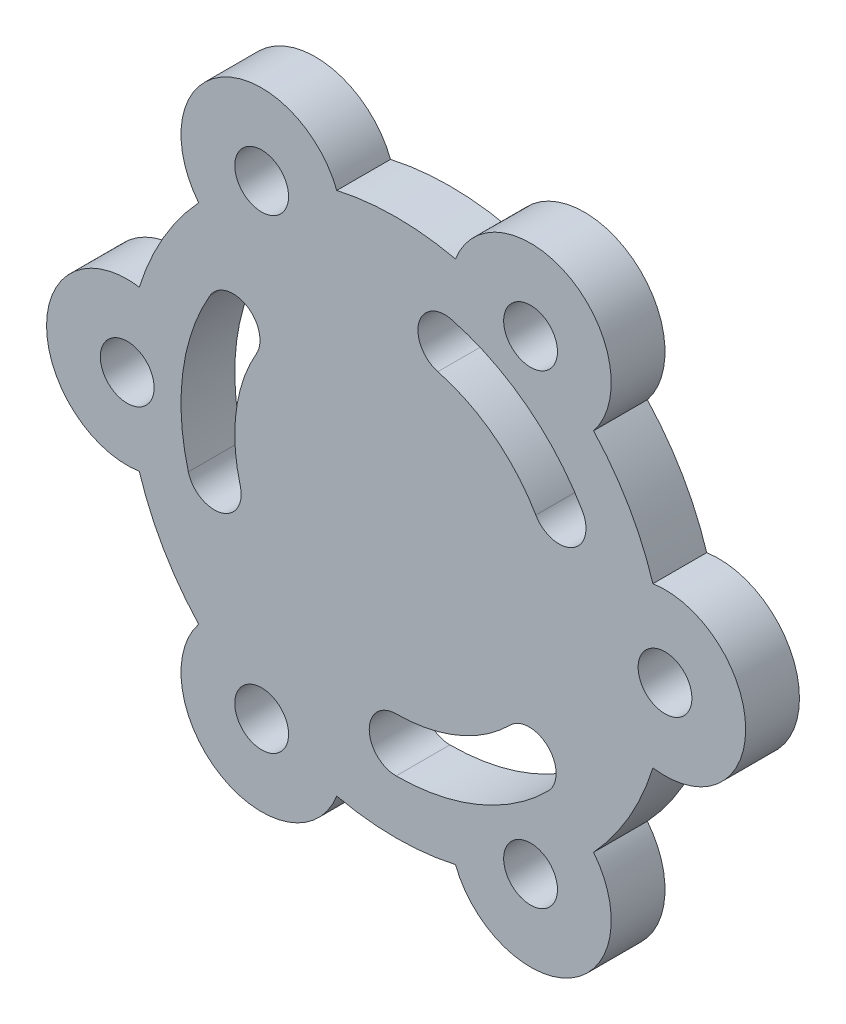
ISO-10303-21;
HEADER;
FILE_DESCRIPTION(('STEP AP214'),'2;1');
FILE_NAME('part.step','',(''),(''),'','','');
FILE_SCHEMA(('AUTOMOTIVE_DESIGN { 1 0 10303 214 1 1 1 1 }'));
ENDSEC;
DATA;
#1=APPLICATION_CONTEXT('core data for automotive mechanical design processes');
#2=APPLICATION_PROTOCOL_DEFINITION('international standard','automotive_design',2000,#1);
#3=PRODUCT_CONTEXT('',#1,'mechanical');
#4=PRODUCT('Part','Part','',(#3));
#5=PRODUCT_RELATED_PRODUCT_CATEGORY('part','',(#4));
#6=PRODUCT_DEFINITION_FORMATION('','',#4);
#7=PRODUCT_DEFINITION_CONTEXT('part definition',#1,'design');
#8=PRODUCT_DEFINITION('design','',#6,#7);
#9=PRODUCT_DEFINITION_SHAPE('','',#8);
#10=(LENGTH_UNIT() NAMED_UNIT(*) SI_UNIT(.MILLI.,.METRE.));
#11=(NAMED_UNIT(*) PLANE_ANGLE_UNIT() SI_UNIT($,.RADIAN.));
#12=(NAMED_UNIT(*) SI_UNIT($,.STERADIAN.) SOLID_ANGLE_UNIT());
#13=UNCERTAINTY_MEASURE_WITH_UNIT(LENGTH_MEASURE(1.E-05),#10,'distance_accuracy_value','');
#14=(GEOMETRIC_REPRESENTATION_CONTEXT(3) GLOBAL_UNCERTAINTY_ASSIGNED_CONTEXT((#13)) GLOBAL_UNIT_ASSIGNED_CONTEXT((#10,
#11,#12)) REPRESENTATION_CONTEXT('',''));
#15=CARTESIAN_POINT('',(0.,0.,0.));
#16=DIRECTION('',(0.,0.,1.));
#17=DIRECTION('',(1.,0.,0.));
#18=AXIS2_PLACEMENT_3D('',#15,#16,#17);
#19=CARTESIAN_POINT('',(25.,-43.3012701892219,10.));
#20=DIRECTION('',(0.,0.,-1.));
#21=DIRECTION('',(-1.,0.,0.));
#22=AXIS2_PLACEMENT_3D('',#19,#20,#21);
#23=CYLINDRICAL_SURFACE('',#22,15.);
#24=CARTESIAN_POINT('',(25.,-43.3012701892219,0.));
#25=DIRECTION('',(0.,0.,1.));
#26=DIRECTION('',(1.,0.,0.));
#27=AXIS2_PLACEMENT_3D('',#24,#25,#26);
#28=CIRCLE('',#27,15.);
#29=CARTESIAN_POINT('',(11.0315921578422,-48.7678580056889,0.));
#30=VERTEX_POINT('',#29);
#31=CARTESIAN_POINT('',(36.7184078421578,-33.937568055725,0.));
#32=VERTEX_POINT('',#31);
#33=EDGE_CURVE('E285',#30,#32,#28,.T.);
#34=ORIENTED_EDGE('',*,*,#33,.T.);
#35=DIRECTION('',(0.,0.,-1.));
#36=VECTOR('',#35,1.);
#37=CARTESIAN_POINT('',(36.7184078421578,-33.937568055725,10.));
#38=LINE('',#37,#36);
#39=CARTESIAN_POINT('',(36.7184078421578,-33.937568055725,10.));
#40=VERTEX_POINT('',#39);
#41=EDGE_CURVE('E11',#40,#32,#38,.T.);
#42=ORIENTED_EDGE('',*,*,#41,.F.);
#43=CARTESIAN_POINT('',(25.,-43.3012701892219,10.));
#44=DIRECTION('',(0.,0.,1.));
#45=DIRECTION('',(1.,0.,0.));
#46=AXIS2_PLACEMENT_3D('',#43,#44,#45);
#47=CIRCLE('',#46,15.);
#48=CARTESIAN_POINT('',(11.0315921578422,-48.7678580056889,10.));
#49=VERTEX_POINT('',#48);
#50=EDGE_CURVE('E419',#49,#40,#47,.T.);
#51=ORIENTED_EDGE('',*,*,#50,.F.);
#52=DIRECTION('',(0.,0.,-1.));
#53=VECTOR('',#52,1.);
#54=CARTESIAN_POINT('',(11.0315921578422,-48.7678580056889,10.));
#55=LINE('',#54,#53);
#56=EDGE_CURVE('E308',#49,#30,#55,.T.);
#57=ORIENTED_EDGE('',*,*,#56,.T.);
#58=EDGE_LOOP('',(#34,#42,#51,#57));
#59=FACE_BOUND('',#58,.T.);
#60=ADVANCED_FACE('F35',(#59),#23,.T.);
#61=CARTESIAN_POINT('',(0.,0.,10.));
#62=DIRECTION('',(0.,0.,-1.));
#63=DIRECTION('',(-1.,0.,0.));
#64=AXIS2_PLACEMENT_3D('',#61,#62,#63);
#65=CYLINDRICAL_SURFACE('',#64,50.);
#66=CARTESIAN_POINT('',(0.,0.,0.));
#67=DIRECTION('',(0.,0.,1.));
#68=DIRECTION('',(1.,0.,0.));
#69=AXIS2_PLACEMENT_3D('',#66,#67,#68);
#70=CIRCLE('',#69,50.);
#71=CARTESIAN_POINT('',(47.75,-14.8302899499639,0.));
#72=VERTEX_POINT('',#71);
#73=EDGE_CURVE('E288',#32,#72,#70,.T.);
#74=ORIENTED_EDGE('',*,*,#73,.T.);
#75=DIRECTION('',(0.,0.,-1.));
#76=VECTOR('',#75,1.);
#77=CARTESIAN_POINT('',(47.75,-14.8302899499639,10.));
#78=LINE('',#77,#76);
#79=CARTESIAN_POINT('',(47.75,-14.8302899499639,10.));
#80=VERTEX_POINT('',#79);
#81=EDGE_CURVE('E45',#80,#72,#78,.T.);
#82=ORIENTED_EDGE('',*,*,#81,.F.);
#83=CARTESIAN_POINT('',(0.,0.,10.));
#84=DIRECTION('',(0.,0.,1.));
#85=DIRECTION('',(1.,0.,0.));
#86=AXIS2_PLACEMENT_3D('',#83,#84,#85);
#87=CIRCLE('',#86,50.);
#88=EDGE_CURVE('E421',#40,#80,#87,.T.);
#89=ORIENTED_EDGE('',*,*,#88,.F.);
#90=ORIENTED_EDGE('',*,*,#41,.T.);
#91=EDGE_LOOP('',(#74,#82,#89,#90));
#92=FACE_BOUND('',#91,.T.);
#93=ADVANCED_FACE('F463',(#92),#65,.T.);
#94=CARTESIAN_POINT('',(50.,0.,10.));
#95=DIRECTION('',(0.,0.,-1.));
#96=DIRECTION('',(-1.,0.,0.));
#97=AXIS2_PLACEMENT_3D('',#94,#95,#96);
#98=CYLINDRICAL_SURFACE('',#97,15.);
#99=CARTESIAN_POINT('',(50.,0.,0.));
#100=DIRECTION('',(0.,0.,1.));
#101=DIRECTION('',(1.,0.,0.));
#102=AXIS2_PLACEMENT_3D('',#99,#100,#101);
#103=CIRCLE('',#102,15.);
#104=CARTESIAN_POINT('',(47.75,14.8302899499639,0.));
#105=VERTEX_POINT('',#104);
#106=EDGE_CURVE('E290',#72,#105,#103,.T.);
#107=ORIENTED_EDGE('',*,*,#106,.T.);
#108=DIRECTION('',(0.,0.,-1.));
#109=VECTOR('',#108,1.);
#110=CARTESIAN_POINT('',(47.75,14.8302899499639,10.));
#111=LINE('',#110,#109);
#112=CARTESIAN_POINT('',(47.75,14.8302899499639,10.));
#113=VERTEX_POINT('',#112);
#114=EDGE_CURVE('E328',#113,#105,#111,.T.);
#115=ORIENTED_EDGE('',*,*,#114,.F.);
#116=CARTESIAN_POINT('',(50.,0.,10.));
#117=DIRECTION('',(0.,0.,1.));
#118=DIRECTION('',(1.,0.,0.));
#119=AXIS2_PLACEMENT_3D('',#116,#117,#118);
#120=CIRCLE('',#119,15.);
#121=EDGE_CURVE('E423',#80,#113,#120,.T.);
#122=ORIENTED_EDGE('',*,*,#121,.F.);
#123=ORIENTED_EDGE('',*,*,#81,.T.);
#124=EDGE_LOOP('',(#107,#115,#122,#123));
#125=FACE_BOUND('',#124,.T.);
#126=ADVANCED_FACE('F468',(#125),#98,.T.);
#127=CARTESIAN_POINT('',(0.,0.,10.));
#128=DIRECTION('',(0.,0.,-1.));
#129=DIRECTION('',(-1.,0.,0.));
#130=AXIS2_PLACEMENT_3D('',#127,#128,#129);
#131=CYLINDRICAL_SURFACE('',#130,50.);
#132=CARTESIAN_POINT('',(0.,0.,0.));
#133=DIRECTION('',(0.,0.,1.));
#134=DIRECTION('',(1.,0.,0.));
#135=AXIS2_PLACEMENT_3D('',#132,#133,#134);
#136=CIRCLE('',#135,50.);
#137=CARTESIAN_POINT('',(36.7184078421578,33.937568055725,0.));
#138=VERTEX_POINT('',#137);
#139=EDGE_CURVE('E292',#105,#138,#136,.T.);
#140=ORIENTED_EDGE('',*,*,#139,.T.);
#141=DIRECTION('',(0.,0.,-1.));
#142=VECTOR('',#141,1.);
#143=CARTESIAN_POINT('',(36.7184078421578,33.937568055725,10.));
#144=LINE('',#143,#142);
#145=CARTESIAN_POINT('',(36.7184078421578,33.937568055725,10.));
#146=VERTEX_POINT('',#145);
#147=EDGE_CURVE('E325',#146,#138,#144,.T.);
#148=ORIENTED_EDGE('',*,*,#147,.F.);
#149=CARTESIAN_POINT('',(0.,0.,10.));
#150=DIRECTION('',(0.,0.,1.));
#151=DIRECTION('',(1.,0.,0.));
#152=AXIS2_PLACEMENT_3D('',#149,#150,#151);
#153=CIRCLE('',#152,50.);
#154=EDGE_CURVE('E425',#113,#146,#153,.T.);
#155=ORIENTED_EDGE('',*,*,#154,.F.);
#156=ORIENTED_EDGE('',*,*,#114,.T.);
#157=EDGE_LOOP('',(#140,#148,#155,#156));
#158=FACE_BOUND('',#157,.T.);
#159=ADVANCED_FACE('F605',(#158),#131,.T.);
#160=CARTESIAN_POINT('',(25.,43.301270189222,10.));
#161=DIRECTION('',(0.,0.,-1.));
#162=DIRECTION('',(-1.,0.,0.));
#163=AXIS2_PLACEMENT_3D('',#160,#161,#162);
#164=CYLINDRICAL_SURFACE('',#163,15.);
#165=CARTESIAN_POINT('',(25.,43.301270189222,0.));
#166=DIRECTION('',(0.,0.,1.));
#167=DIRECTION('',(1.,0.,0.));
#168=AXIS2_PLACEMENT_3D('',#165,#166,#167);
#169=CIRCLE('',#168,15.);
#170=CARTESIAN_POINT('',(11.0315921578422,48.7678580056889,0.));
#171=VERTEX_POINT('',#170);
#172=EDGE_CURVE('E294',#138,#171,#169,.T.);
#173=ORIENTED_EDGE('',*,*,#172,.T.);
#174=DIRECTION('',(0.,0.,-1.));
#175=VECTOR('',#174,1.);
#176=CARTESIAN_POINT('',(11.0315921578422,48.7678580056889,10.));
#177=LINE('',#176,#175);
#178=CARTESIAN_POINT('',(11.0315921578422,48.7678580056889,10.));
#179=VERTEX_POINT('',#178);
#180=EDGE_CURVE('E322',#179,#171,#177,.T.);
#181=ORIENTED_EDGE('',*,*,#180,.F.);
#182=CARTESIAN_POINT('',(25.,43.301270189222,10.));
#183=DIRECTION('',(0.,0.,1.));
#184=DIRECTION('',(1.,0.,0.));
#185=AXIS2_PLACEMENT_3D('',#182,#183,#184);
#186=CIRCLE('',#185,15.);
#187=EDGE_CURVE('E427',#146,#179,#186,.T.);
#188=ORIENTED_EDGE('',*,*,#187,.F.);
#189=ORIENTED_EDGE('',*,*,#147,.T.);
#190=EDGE_LOOP('',(#173,#181,#188,#189));
#191=FACE_BOUND('',#190,.T.);
#192=ADVANCED_FACE('F597',(#191),#164,.T.);
#193=CARTESIAN_POINT('',(0.,0.,10.));
#194=DIRECTION('',(0.,0.,-1.));
#195=DIRECTION('',(-1.,0.,0.));
#196=AXIS2_PLACEMENT_3D('',#193,#194,#195);
#197=CYLINDRICAL_SURFACE('',#196,50.);
#198=CARTESIAN_POINT('',(0.,0.,0.));
#199=DIRECTION('',(0.,0.,1.));
#200=DIRECTION('',(1.,0.,0.));
#201=AXIS2_PLACEMENT_3D('',#198,#199,#200);
#202=CIRCLE('',#201,50.);
#203=CARTESIAN_POINT('',(-11.0315921578423,48.7678580056889,0.));
#204=VERTEX_POINT('',#203);
#205=EDGE_CURVE('E296',#171,#204,#202,.T.);
#206=ORIENTED_EDGE('',*,*,#205,.T.);
#207=DIRECTION('',(0.,0.,-1.));
#208=VECTOR('',#207,1.);
#209=CARTESIAN_POINT('',(-11.0315921578423,48.7678580056889,10.));
#210=LINE('',#209,#208);
#211=CARTESIAN_POINT('',(-11.0315921578423,48.7678580056889,10.));
#212=VERTEX_POINT('',#211);
#213=EDGE_CURVE('E319',#212,#204,#210,.T.);
#214=ORIENTED_EDGE('',*,*,#213,.F.);
#215=CARTESIAN_POINT('',(0.,0.,10.));
#216=DIRECTION('',(0.,0.,1.));
#217=DIRECTION('',(1.,0.,0.));
#218=AXIS2_PLACEMENT_3D('',#215,#216,#217);
#219=CIRCLE('',#218,50.);
#220=EDGE_CURVE('E429',#179,#212,#219,.T.);
#221=ORIENTED_EDGE('',*,*,#220,.F.);
#222=ORIENTED_EDGE('',*,*,#180,.T.);
#223=EDGE_LOOP('',(#206,#214,#221,#222));
#224=FACE_BOUND('',#223,.T.);
#225=ADVANCED_FACE('F589',(#224),#197,.T.);
#226=CARTESIAN_POINT('',(-25.,43.3012701892219,10.));
#227=DIRECTION('',(0.,0.,-1.));
#228=DIRECTION('',(-1.,0.,0.));
#229=AXIS2_PLACEMENT_3D('',#226,#227,#228);
#230=CYLINDRICAL_SURFACE('',#229,15.);
#231=CARTESIAN_POINT('',(-25.,43.3012701892219,0.));
#232=DIRECTION('',(0.,0.,1.));
#233=DIRECTION('',(1.,0.,0.));
#234=AXIS2_PLACEMENT_3D('',#231,#232,#233);
#235=CIRCLE('',#234,15.);
#236=CARTESIAN_POINT('',(-36.7184078421578,33.937568055725,0.));
#237=VERTEX_POINT('',#236);
#238=EDGE_CURVE('E298',#204,#237,#235,.T.);
#239=ORIENTED_EDGE('',*,*,#238,.T.);
#240=DIRECTION('',(0.,0.,-1.));
#241=VECTOR('',#240,1.);
#242=CARTESIAN_POINT('',(-36.7184078421578,33.937568055725,10.));
#243=LINE('',#242,#241);
#244=CARTESIAN_POINT('',(-36.7184078421578,33.937568055725,10.));
#245=VERTEX_POINT('',#244);
#246=EDGE_CURVE('E316',#245,#237,#243,.T.);
#247=ORIENTED_EDGE('',*,*,#246,.F.);
#248=CARTESIAN_POINT('',(-25.,43.3012701892219,10.));
#249=DIRECTION('',(0.,0.,1.));
#250=DIRECTION('',(1.,0.,0.));
#251=AXIS2_PLACEMENT_3D('',#248,#249,#250);
#252=CIRCLE('',#251,15.);
#253=EDGE_CURVE('E431',#212,#245,#252,.T.);
#254=ORIENTED_EDGE('',*,*,#253,.F.);
#255=ORIENTED_EDGE('',*,*,#213,.T.);
#256=EDGE_LOOP('',(#239,#247,#254,#255));
#257=FACE_BOUND('',#256,.T.);
#258=ADVANCED_FACE('F582',(#257),#230,.T.);
#259=CARTESIAN_POINT('',(0.,0.,10.));
#260=DIRECTION('',(0.,0.,-1.));
#261=DIRECTION('',(-1.,0.,0.));
#262=AXIS2_PLACEMENT_3D('',#259,#260,#261);
#263=CYLINDRICAL_SURFACE('',#262,50.);
#264=CARTESIAN_POINT('',(0.,0.,0.));
#265=DIRECTION('',(0.,0.,1.));
#266=DIRECTION('',(1.,0.,0.));
#267=AXIS2_PLACEMENT_3D('',#264,#265,#266);
#268=CIRCLE('',#267,50.);
#269=CARTESIAN_POINT('',(-47.75,14.8302899499639,0.));
#270=VERTEX_POINT('',#269);
#271=EDGE_CURVE('E300',#237,#270,#268,.T.);
#272=ORIENTED_EDGE('',*,*,#271,.T.);
#273=DIRECTION('',(0.,0.,-1.));
#274=VECTOR('',#273,1.);
#275=CARTESIAN_POINT('',(-47.75,14.8302899499639,10.));
#276=LINE('',#275,#274);
#277=CARTESIAN_POINT('',(-47.75,14.8302899499639,10.));
#278=VERTEX_POINT('',#277);
#279=EDGE_CURVE('E313',#278,#270,#276,.T.);
#280=ORIENTED_EDGE('',*,*,#279,.F.);
#281=CARTESIAN_POINT('',(0.,0.,10.));
#282=DIRECTION('',(0.,0.,1.));
#283=DIRECTION('',(1.,0.,0.));
#284=AXIS2_PLACEMENT_3D('',#281,#282,#283);
#285=CIRCLE('',#284,50.);
#286=EDGE_CURVE('E433',#245,#278,#285,.T.);
#287=ORIENTED_EDGE('',*,*,#286,.F.);
#288=ORIENTED_EDGE('',*,*,#246,.T.);
#289=EDGE_LOOP('',(#272,#280,#287,#288));
#290=FACE_BOUND('',#289,.T.);
#291=ADVANCED_FACE('F439',(#290),#263,.T.);
#292=CARTESIAN_POINT('',(-50.,0.,10.));
#293=DIRECTION('',(0.,0.,-1.));
#294=DIRECTION('',(-1.,0.,0.));
#295=AXIS2_PLACEMENT_3D('',#292,#293,#294);
#296=CYLINDRICAL_SURFACE('',#295,15.);
#297=CARTESIAN_POINT('',(-50.,0.,0.));
#298=DIRECTION('',(0.,0.,1.));
#299=DIRECTION('',(1.,0.,0.));
#300=AXIS2_PLACEMENT_3D('',#297,#298,#299);
#301=CIRCLE('',#300,15.);
#302=CARTESIAN_POINT('',(-47.75,-14.8302899499639,0.));
#303=VERTEX_POINT('',#302);
#304=EDGE_CURVE('E302',#270,#303,#301,.T.);
#305=ORIENTED_EDGE('',*,*,#304,.T.);
#306=DIRECTION('',(0.,0.,-1.));
#307=VECTOR('',#306,1.);
#308=CARTESIAN_POINT('',(-47.75,-14.8302899499639,10.));
#309=LINE('',#308,#307);
#310=CARTESIAN_POINT('',(-47.75,-14.8302899499639,10.));
#311=VERTEX_POINT('',#310);
#312=EDGE_CURVE('E222',#311,#303,#309,.T.);
#313=ORIENTED_EDGE('',*,*,#312,.F.);
#314=CARTESIAN_POINT('',(-50.,0.,10.));
#315=DIRECTION('',(0.,0.,1.));
#316=DIRECTION('',(1.,0.,0.));
#317=AXIS2_PLACEMENT_3D('',#314,#315,#316);
#318=CIRCLE('',#317,15.);
#319=EDGE_CURVE('E213',#278,#311,#318,.T.);
#320=ORIENTED_EDGE('',*,*,#319,.F.);
#321=ORIENTED_EDGE('',*,*,#279,.T.);
#322=EDGE_LOOP('',(#305,#313,#320,#321));
#323=FACE_BOUND('',#322,.T.);
#324=ADVANCED_FACE('F443',(#323),#296,.T.);
#325=CARTESIAN_POINT('',(0.,0.,10.));
#326=DIRECTION('',(0.,0.,-1.));
#327=DIRECTION('',(-1.,0.,0.));
#328=AXIS2_PLACEMENT_3D('',#325,#326,#327);
#329=CYLINDRICAL_SURFACE('',#328,50.);
#330=CARTESIAN_POINT('',(0.,0.,0.));
#331=DIRECTION('',(0.,0.,1.));
#332=DIRECTION('',(1.,0.,0.));
#333=AXIS2_PLACEMENT_3D('',#330,#331,#332);
#334=CIRCLE('',#333,50.);
#335=CARTESIAN_POINT('',(-36.7184078421578,-33.937568055725,0.));
#336=VERTEX_POINT('',#335);
#337=EDGE_CURVE('E221',#303,#336,#334,.T.);
#338=ORIENTED_EDGE('',*,*,#337,.T.);
#339=DIRECTION('',(0.,0.,-1.));
#340=VECTOR('',#339,1.);
#341=CARTESIAN_POINT('',(-36.7184078421578,-33.937568055725,10.));
#342=LINE('',#341,#340);
#343=CARTESIAN_POINT('',(-36.7184078421578,-33.937568055725,10.));
#344=VERTEX_POINT('',#343);
#345=EDGE_CURVE('E218',#344,#336,#342,.T.);
#346=ORIENTED_EDGE('',*,*,#345,.F.);
#347=CARTESIAN_POINT('',(0.,0.,10.));
#348=DIRECTION('',(0.,0.,1.));
#349=DIRECTION('',(1.,0.,0.));
#350=AXIS2_PLACEMENT_3D('',#347,#348,#349);
#351=CIRCLE('',#350,50.);
#352=EDGE_CURVE('E207',#311,#344,#351,.T.);
#353=ORIENTED_EDGE('',*,*,#352,.F.);
#354=ORIENTED_EDGE('',*,*,#312,.T.);
#355=EDGE_LOOP('',(#338,#346,#353,#354));
#356=FACE_BOUND('',#355,.T.);
#357=ADVANCED_FACE('F219',(#356),#329,.T.);
#358=CARTESIAN_POINT('',(-25.,-43.301270189222,10.));
#359=DIRECTION('',(0.,0.,-1.));
#360=DIRECTION('',(-1.,0.,0.));
#361=AXIS2_PLACEMENT_3D('',#358,#359,#360);
#362=CYLINDRICAL_SURFACE('',#361,15.);
#363=CARTESIAN_POINT('',(-25.,-43.301270189222,0.));
#364=DIRECTION('',(0.,0.,1.));
#365=DIRECTION('',(1.,0.,0.));
#366=AXIS2_PLACEMENT_3D('',#363,#364,#365);
#367=CIRCLE('',#366,15.);
#368=CARTESIAN_POINT('',(-11.0315921578422,-48.7678580056889,0.));
#369=VERTEX_POINT('',#368);
#370=EDGE_CURVE('E131',#336,#369,#367,.T.);
#371=ORIENTED_EDGE('',*,*,#370,.T.);
#372=DIRECTION('',(0.,0.,-1.));
#373=VECTOR('',#372,1.);
#374=CARTESIAN_POINT('',(-11.0315921578422,-48.7678580056889,10.));
#375=LINE('',#374,#373);
#376=CARTESIAN_POINT('',(-11.0315921578422,-48.7678580056889,10.));
#377=VERTEX_POINT('',#376);
#378=EDGE_CURVE('E223',#377,#369,#375,.T.);
#379=ORIENTED_EDGE('',*,*,#378,.F.);
#380=CARTESIAN_POINT('',(-25.,-43.301270189222,10.));
#381=DIRECTION('',(0.,0.,1.));
#382=DIRECTION('',(1.,0.,0.));
#383=AXIS2_PLACEMENT_3D('',#380,#381,#382);
#384=CIRCLE('',#383,15.);
#385=EDGE_CURVE('E211',#344,#377,#384,.T.);
#386=ORIENTED_EDGE('',*,*,#385,.F.);
#387=ORIENTED_EDGE('',*,*,#345,.T.);
#388=EDGE_LOOP('',(#371,#379,#386,#387));
#389=FACE_BOUND('',#388,.T.);
#390=ADVANCED_FACE('F225',(#389),#362,.T.);
#391=CARTESIAN_POINT('',(9.05866657858811,33.8074039201174,10.));
#392=DIRECTION('',(0.,0.,-1.));
#393=DIRECTION('',(-1.,0.,0.));
#394=AXIS2_PLACEMENT_3D('',#391,#392,#393);
#395=CYLINDRICAL_SURFACE('',#394,5.);
#396=CARTESIAN_POINT('',(9.05866657858811,33.8074039201174,0.));
#397=DIRECTION('',(0.,0.,1.));
#398=DIRECTION('',(1.,0.,0.));
#399=AXIS2_PLACEMENT_3D('',#396,#397,#398);
#400=CIRCLE('',#399,5.);
#401=CARTESIAN_POINT('',(10.3527618041007,38.6370330515628,0.));
#402=VERTEX_POINT('',#401);
#403=CARTESIAN_POINT('',(7.76457135307553,28.9777747886721,0.));
#404=VERTEX_POINT('',#403);
#405=EDGE_CURVE('E255',#402,#404,#400,.T.);
#406=ORIENTED_EDGE('',*,*,#405,.F.);
#407=DIRECTION('',(0.,0.,-1.));
#408=VECTOR('',#407,1.);
#409=CARTESIAN_POINT('',(10.3527618041007,38.6370330515628,10.));
#410=LINE('',#409,#408);
#411=CARTESIAN_POINT('',(10.3527618041007,38.6370330515628,10.));
#412=VERTEX_POINT('',#411);
#413=EDGE_CURVE('E310',#412,#402,#410,.T.);
#414=ORIENTED_EDGE('',*,*,#413,.F.);
#415=CARTESIAN_POINT('',(9.05866657858811,33.8074039201174,10.));
#416=DIRECTION('',(0.,0.,1.));
#417=DIRECTION('',(1.,0.,0.));
#418=AXIS2_PLACEMENT_3D('',#415,#416,#417);
#419=CIRCLE('',#418,5.);
#420=CARTESIAN_POINT('',(7.76457135307553,28.9777747886721,10.));
#421=VERTEX_POINT('',#420);
#422=EDGE_CURVE('E390',#412,#421,#419,.T.);
#423=ORIENTED_EDGE('',*,*,#422,.T.);
#424=DIRECTION('',(0.,0.,-1.));
#425=VECTOR('',#424,1.);
#426=CARTESIAN_POINT('',(7.76457135307553,28.9777747886721,10.));
#427=LINE('',#426,#425);
#428=EDGE_CURVE('E333',#421,#404,#427,.T.);
#429=ORIENTED_EDGE('',*,*,#428,.T.);
#430=EDGE_LOOP('',(#406,#414,#423,#429));
#431=FACE_BOUND('',#430,.T.);
#432=ADVANCED_FACE('F509',(#431),#395,.F.);
#433=CARTESIAN_POINT('',(0.,0.,10.));
#434=DIRECTION('',(0.,0.,-1.));
#435=DIRECTION('',(-1.,0.,0.));
#436=AXIS2_PLACEMENT_3D('',#433,#434,#435);
#437=CYLINDRICAL_SURFACE('',#436,40.);
#438=CARTESIAN_POINT('',(0.,0.,0.));
#439=DIRECTION('',(0.,0.,1.));
#440=DIRECTION('',(1.,0.,0.));
#441=AXIS2_PLACEMENT_3D('',#438,#439,#440);
#442=CIRCLE('',#441,40.);
#443=CARTESIAN_POINT('',(34.6410161513775,20.,0.));
#444=VERTEX_POINT('',#443);
#445=EDGE_CURVE('E258',#444,#402,#442,.T.);
#446=ORIENTED_EDGE('',*,*,#445,.F.);
#447=DIRECTION('',(0.,0.,-1.));
#448=VECTOR('',#447,1.);
#449=CARTESIAN_POINT('',(34.6410161513775,20.,10.));
#450=LINE('',#449,#448);
#451=CARTESIAN_POINT('',(34.6410161513775,20.,10.));
#452=VERTEX_POINT('',#451);
#453=EDGE_CURVE('E338',#452,#444,#450,.T.);
#454=ORIENTED_EDGE('',*,*,#453,.F.);
#455=CARTESIAN_POINT('',(0.,0.,10.));
#456=DIRECTION('',(0.,0.,1.));
#457=DIRECTION('',(1.,0.,0.));
#458=AXIS2_PLACEMENT_3D('',#455,#456,#457);
#459=CIRCLE('',#458,40.);
#460=EDGE_CURVE('E393',#452,#412,#459,.T.);
#461=ORIENTED_EDGE('',*,*,#460,.T.);
#462=ORIENTED_EDGE('',*,*,#413,.T.);
#463=EDGE_LOOP('',(#446,#454,#461,#462));
#464=FACE_BOUND('',#463,.T.);
#465=ADVANCED_FACE('F505',(#464),#437,.F.);
#466=CARTESIAN_POINT('',(30.3108891324553,17.5,10.));
#467=DIRECTION('',(0.,0.,-1.));
#468=DIRECTION('',(-1.,0.,0.));
#469=AXIS2_PLACEMENT_3D('',#466,#467,#468);
#470=CYLINDRICAL_SURFACE('',#469,4.99999999999999);
#471=CARTESIAN_POINT('',(30.3108891324553,17.5,0.));
#472=DIRECTION('',(0.,0.,1.));
#473=DIRECTION('',(1.,0.,0.));
#474=AXIS2_PLACEMENT_3D('',#471,#472,#473);
#475=CIRCLE('',#474,4.99999999999999);
#476=CARTESIAN_POINT('',(25.9807621135331,15.,0.));
#477=VERTEX_POINT('',#476);
#478=EDGE_CURVE('E261',#477,#444,#475,.T.);
#479=ORIENTED_EDGE('',*,*,#478,.F.);
#480=DIRECTION('',(0.,0.,-1.));
#481=VECTOR('',#480,1.);
#482=CARTESIAN_POINT('',(25.9807621135331,15.,10.));
#483=LINE('',#482,#481);
#484=CARTESIAN_POINT('',(25.9807621135331,15.,10.));
#485=VERTEX_POINT('',#484);
#486=EDGE_CURVE('E335',#485,#477,#483,.T.);
#487=ORIENTED_EDGE('',*,*,#486,.F.);
#488=CARTESIAN_POINT('',(30.3108891324553,17.5,10.));
#489=DIRECTION('',(0.,0.,1.));
#490=DIRECTION('',(1.,0.,0.));
#491=AXIS2_PLACEMENT_3D('',#488,#489,#490);
#492=CIRCLE('',#491,4.99999999999999);
#493=EDGE_CURVE('E396',#485,#452,#492,.T.);
#494=ORIENTED_EDGE('',*,*,#493,.T.);
#495=ORIENTED_EDGE('',*,*,#453,.T.);
#496=EDGE_LOOP('',(#479,#487,#494,#495));
#497=FACE_BOUND('',#496,.T.);
#498=ADVANCED_FACE('F501',(#497),#470,.F.);
#499=CARTESIAN_POINT('',(24.7487373415291,-24.7487373415292,10.));
#500=DIRECTION('',(0.,0.,-1.));
#501=DIRECTION('',(-1.,0.,0.));
#502=AXIS2_PLACEMENT_3D('',#499,#500,#501);
#503=CYLINDRICAL_SURFACE('',#502,5.);
#504=CARTESIAN_POINT('',(24.7487373415291,-24.7487373415292,0.));
#505=DIRECTION('',(0.,0.,1.));
#506=DIRECTION('',(1.,0.,0.));
#507=AXIS2_PLACEMENT_3D('',#504,#505,#506);
#508=CIRCLE('',#507,5.);
#509=CARTESIAN_POINT('',(28.2842712474618,-28.284271247462,0.));
#510=VERTEX_POINT('',#509);
#511=CARTESIAN_POINT('',(21.2132034355964,-21.2132034355965,0.));
#512=VERTEX_POINT('',#511);
#513=EDGE_CURVE('E243',#510,#512,#508,.T.);
#514=ORIENTED_EDGE('',*,*,#513,.F.);
#515=DIRECTION('',(0.,0.,-1.));
#516=VECTOR('',#515,1.);
#517=CARTESIAN_POINT('',(28.2842712474618,-28.284271247462,10.));
#518=LINE('',#517,#516);
#519=CARTESIAN_POINT('',(28.2842712474618,-28.284271247462,10.));
#520=VERTEX_POINT('',#519);
#521=EDGE_CURVE('E336',#520,#510,#518,.T.);
#522=ORIENTED_EDGE('',*,*,#521,.F.);
#523=CARTESIAN_POINT('',(24.7487373415291,-24.7487373415292,10.));
#524=DIRECTION('',(0.,0.,1.));
#525=DIRECTION('',(1.,0.,0.));
#526=AXIS2_PLACEMENT_3D('',#523,#524,#525);
#527=CIRCLE('',#526,5.);
#528=CARTESIAN_POINT('',(21.2132034355964,-21.2132034355965,10.));
#529=VERTEX_POINT('',#528);
#530=EDGE_CURVE('E373',#520,#529,#527,.T.);
#531=ORIENTED_EDGE('',*,*,#530,.T.);
#532=DIRECTION('',(0.,0.,-1.));
#533=VECTOR('',#532,1.);
#534=CARTESIAN_POINT('',(21.2132034355964,-21.2132034355965,10.));
#535=LINE('',#534,#533);
#536=EDGE_CURVE('E341',#529,#512,#535,.T.);
#537=ORIENTED_EDGE('',*,*,#536,.T.);
#538=EDGE_LOOP('',(#514,#522,#531,#537));
#539=FACE_BOUND('',#538,.T.);
#540=ADVANCED_FACE('F504',(#539),#503,.F.);
#541=CARTESIAN_POINT('',(0.,0.,10.));
#542=DIRECTION('',(0.,0.,-1.));
#543=DIRECTION('',(-1.,0.,0.));
#544=AXIS2_PLACEMENT_3D('',#541,#542,#543);
#545=CYLINDRICAL_SURFACE('',#544,40.);
#546=CARTESIAN_POINT('',(0.,0.,0.));
#547=DIRECTION('',(0.,0.,1.));
#548=DIRECTION('',(1.,0.,0.));
#549=AXIS2_PLACEMENT_3D('',#546,#547,#548);
#550=CIRCLE('',#549,40.);
#551=CARTESIAN_POINT('',(-1.49456427946904E-13,-40.,0.));
#552=VERTEX_POINT('',#551);
#553=EDGE_CURVE('E246',#552,#510,#550,.T.);
#554=ORIENTED_EDGE('',*,*,#553,.F.);
#555=DIRECTION('',(0.,0.,-1.));
#556=VECTOR('',#555,1.);
#557=CARTESIAN_POINT('',(-1.49456427946904E-13,-40.,10.));
#558=LINE('',#557,#556);
#559=CARTESIAN_POINT('',(-1.49456427946904E-13,-40.,10.));
#560=VERTEX_POINT('',#559);
#561=EDGE_CURVE('E345',#560,#552,#558,.T.);
#562=ORIENTED_EDGE('',*,*,#561,.F.);
#563=CARTESIAN_POINT('',(0.,0.,10.));
#564=DIRECTION('',(0.,0.,1.));
#565=DIRECTION('',(1.,0.,0.));
#566=AXIS2_PLACEMENT_3D('',#563,#564,#565);
#567=CIRCLE('',#566,40.);
#568=EDGE_CURVE('E382',#560,#520,#567,.T.);
#569=ORIENTED_EDGE('',*,*,#568,.T.);
#570=ORIENTED_EDGE('',*,*,#521,.T.);
#571=EDGE_LOOP('',(#554,#562,#569,#570));
#572=FACE_BOUND('',#571,.T.);
#573=ADVANCED_FACE('F520',(#572),#545,.F.);
#574=CARTESIAN_POINT('',(-1.17961196366423E-13,-35.,10.));
#575=DIRECTION('',(0.,0.,-1.));
#576=DIRECTION('',(-1.,0.,0.));
#577=AXIS2_PLACEMENT_3D('',#574,#575,#576);
#578=CYLINDRICAL_SURFACE('',#577,5.);
#579=CARTESIAN_POINT('',(-1.17961196366423E-13,-35.,0.));
#580=DIRECTION('',(0.,0.,1.));
#581=DIRECTION('',(1.,0.,0.));
#582=AXIS2_PLACEMENT_3D('',#579,#580,#581);
#583=CIRCLE('',#582,5.);
#584=CARTESIAN_POINT('',(-1.12092320960178E-13,-30.,0.));
#585=VERTEX_POINT('',#584);
#586=EDGE_CURVE('E249',#585,#552,#583,.T.);
#587=ORIENTED_EDGE('',*,*,#586,.F.);
#588=DIRECTION('',(0.,0.,-1.));
#589=VECTOR('',#588,1.);
#590=CARTESIAN_POINT('',(-1.12092320960178E-13,-30.,10.));
#591=LINE('',#590,#589);
#592=CARTESIAN_POINT('',(-1.12092320960178E-13,-30.,10.));
#593=VERTEX_POINT('',#592);
#594=EDGE_CURVE('E343',#593,#585,#591,.T.);
#595=ORIENTED_EDGE('',*,*,#594,.F.);
#596=CARTESIAN_POINT('',(-1.17961196366423E-13,-35.,10.));
#597=DIRECTION('',(0.,0.,1.));
#598=DIRECTION('',(1.,0.,0.));
#599=AXIS2_PLACEMENT_3D('',#596,#597,#598);
#600=CIRCLE('',#599,5.);
#601=EDGE_CURVE('E385',#593,#560,#600,.T.);
#602=ORIENTED_EDGE('',*,*,#601,.T.);
#603=ORIENTED_EDGE('',*,*,#561,.T.);
#604=EDGE_LOOP('',(#587,#595,#602,#603));
#605=FACE_BOUND('',#604,.T.);
#606=ADVANCED_FACE('F517',(#605),#578,.F.);
#607=CARTESIAN_POINT('',(-33.8074039201174,-9.05866657858804,10.));
#608=DIRECTION('',(0.,0.,-1.));
#609=DIRECTION('',(-1.,0.,0.));
#610=AXIS2_PLACEMENT_3D('',#607,#608,#609);
#611=CYLINDRICAL_SURFACE('',#610,5.);
#612=CARTESIAN_POINT('',(-33.8074039201174,-9.05866657858804,0.));
#613=DIRECTION('',(0.,0.,1.));
#614=DIRECTION('',(1.,0.,0.));
#615=AXIS2_PLACEMENT_3D('',#612,#613,#614);
#616=CIRCLE('',#615,5.);
#617=CARTESIAN_POINT('',(-38.6370330515628,-10.3527618041006,0.));
#618=VERTEX_POINT('',#617);
#619=CARTESIAN_POINT('',(-28.9777747886721,-7.76457135307546,0.));
#620=VERTEX_POINT('',#619);
#621=EDGE_CURVE('E231',#618,#620,#616,.T.);
#622=ORIENTED_EDGE('',*,*,#621,.F.);
#623=DIRECTION('',(0.,0.,-1.));
#624=VECTOR('',#623,1.);
#625=CARTESIAN_POINT('',(-38.6370330515628,-10.3527618041006,10.));
#626=LINE('',#625,#624);
#627=CARTESIAN_POINT('',(-38.6370330515628,-10.3527618041006,10.));
#628=VERTEX_POINT('',#627);
#629=EDGE_CURVE('E39',#628,#618,#626,.T.);
#630=ORIENTED_EDGE('',*,*,#629,.F.);
#631=CARTESIAN_POINT('',(-33.8074039201174,-9.05866657858804,10.));
#632=DIRECTION('',(0.,0.,1.));
#633=DIRECTION('',(1.,0.,0.));
#634=AXIS2_PLACEMENT_3D('',#631,#632,#633);
#635=CIRCLE('',#634,5.);
#636=CARTESIAN_POINT('',(-28.9777747886721,-7.76457135307546,10.));
#637=VERTEX_POINT('',#636);
#638=EDGE_CURVE('E307',#628,#637,#635,.T.);
#639=ORIENTED_EDGE('',*,*,#638,.T.);
#640=DIRECTION('',(0.,0.,-1.));
#641=VECTOR('',#640,1.);
#642=CARTESIAN_POINT('',(-28.9777747886721,-7.76457135307546,10.));
#643=LINE('',#642,#641);
#644=EDGE_CURVE('E227',#637,#620,#643,.T.);
#645=ORIENTED_EDGE('',*,*,#644,.T.);
#646=EDGE_LOOP('',(#622,#630,#639,#645));
#647=FACE_BOUND('',#646,.T.);
#648=ADVANCED_FACE('F37',(#647),#611,.F.);
#649=CARTESIAN_POINT('',(0.,0.,10.));
#650=DIRECTION('',(0.,0.,-1.));
#651=DIRECTION('',(-1.,0.,0.));
#652=AXIS2_PLACEMENT_3D('',#649,#650,#651);
#653=CYLINDRICAL_SURFACE('',#652,40.);
#654=CARTESIAN_POINT('',(0.,0.,0.));
#655=DIRECTION('',(0.,0.,1.));
#656=DIRECTION('',(1.,0.,0.));
#657=AXIS2_PLACEMENT_3D('',#654,#655,#656);
#658=CIRCLE('',#657,40.);
#659=CARTESIAN_POINT('',(-34.6410161513774,20.0000000000003,0.));
#660=VERTEX_POINT('',#659);
#661=EDGE_CURVE('E234',#660,#618,#658,.T.);
#662=ORIENTED_EDGE('',*,*,#661,.F.);
#663=DIRECTION('',(0.,0.,-1.));
#664=VECTOR('',#663,1.);
#665=CARTESIAN_POINT('',(-34.6410161513774,20.0000000000003,10.));
#666=LINE('',#665,#664);
#667=CARTESIAN_POINT('',(-34.6410161513774,20.0000000000003,10.));
#668=VERTEX_POINT('',#667);
#669=EDGE_CURVE('E350',#668,#660,#666,.T.);
#670=ORIENTED_EDGE('',*,*,#669,.F.);
#671=CARTESIAN_POINT('',(0.,0.,10.));
#672=DIRECTION('',(0.,0.,1.));
#673=DIRECTION('',(1.,0.,0.));
#674=AXIS2_PLACEMENT_3D('',#671,#672,#673);
#675=CIRCLE('',#674,40.);
#676=EDGE_CURVE('E359',#668,#628,#675,.T.);
#677=ORIENTED_EDGE('',*,*,#676,.T.);
#678=ORIENTED_EDGE('',*,*,#629,.T.);
#679=EDGE_LOOP('',(#662,#670,#677,#678));
#680=FACE_BOUND('',#679,.T.);
#681=ADVANCED_FACE('F357',(#680),#653,.F.);
#682=CARTESIAN_POINT('',(-30.3108891324552,17.5000000000002,10.));
#683=DIRECTION('',(0.,0.,-1.));
#684=DIRECTION('',(-1.,0.,0.));
#685=AXIS2_PLACEMENT_3D('',#682,#683,#684);
#686=CYLINDRICAL_SURFACE('',#685,4.99999999999999);
#687=CARTESIAN_POINT('',(-30.3108891324552,17.5000000000002,0.));
#688=DIRECTION('',(0.,0.,1.));
#689=DIRECTION('',(1.,0.,0.));
#690=AXIS2_PLACEMENT_3D('',#687,#688,#689);
#691=CIRCLE('',#690,4.99999999999999);
#692=CARTESIAN_POINT('',(-25.9807621135331,15.0000000000002,0.));
#693=VERTEX_POINT('',#692);
#694=EDGE_CURVE('E237',#693,#660,#691,.T.);
#695=ORIENTED_EDGE('',*,*,#694,.F.);
#696=DIRECTION('',(0.,0.,-1.));
#697=VECTOR('',#696,1.);
#698=CARTESIAN_POINT('',(-25.9807621135331,15.0000000000002,10.));
#699=LINE('',#698,#697);
#700=CARTESIAN_POINT('',(-25.9807621135331,15.0000000000002,10.));
#701=VERTEX_POINT('',#700);
#702=EDGE_CURVE('E349',#701,#693,#699,.T.);
#703=ORIENTED_EDGE('',*,*,#702,.F.);
#704=CARTESIAN_POINT('',(-30.3108891324552,17.5000000000002,10.));
#705=DIRECTION('',(0.,0.,1.));
#706=DIRECTION('',(1.,0.,0.));
#707=AXIS2_PLACEMENT_3D('',#704,#705,#706);
#708=CIRCLE('',#707,4.99999999999999);
#709=EDGE_CURVE('E368',#701,#668,#708,.T.);
#710=ORIENTED_EDGE('',*,*,#709,.T.);
#711=ORIENTED_EDGE('',*,*,#669,.T.);
#712=EDGE_LOOP('',(#695,#703,#710,#711));
#713=FACE_BOUND('',#712,.T.);
#714=ADVANCED_FACE('F365',(#713),#686,.F.);
#715=CARTESIAN_POINT('',(-25.,-43.301270189222,10.));
#716=DIRECTION('',(0.,0.,-1.));
#717=DIRECTION('',(-1.,0.,0.));
#718=AXIS2_PLACEMENT_3D('',#715,#716,#717);
#719=CYLINDRICAL_SURFACE('',#718,5.);
#720=CARTESIAN_POINT('',(-25.,-43.301270189222,10.));
#721=DIRECTION('',(0.,0.,1.));
#722=DIRECTION('',(1.,0.,0.));
#723=AXIS2_PLACEMENT_3D('',#720,#721,#722);
#724=CIRCLE('',#723,5.);
#725=CARTESIAN_POINT('',(-20.,-43.301270189222,10.));
#726=VERTEX_POINT('',#725);
#727=EDGE_CURVE('E416',#726,#726,#724,.T.);
#728=ORIENTED_EDGE('',*,*,#727,.T.);
#729=EDGE_LOOP('',(#728));
#730=FACE_BOUND('',#729,.T.);
#731=CARTESIAN_POINT('',(-25.,-43.301270189222,0.));
#732=DIRECTION('',(0.,0.,1.));
#733=DIRECTION('',(1.,0.,0.));
#734=AXIS2_PLACEMENT_3D('',#731,#732,#733);
#735=CIRCLE('',#734,5.);
#736=CARTESIAN_POINT('',(-20.,-43.301270189222,0.));
#737=VERTEX_POINT('',#736);
#738=EDGE_CURVE('E282',#737,#737,#735,.T.);
#739=ORIENTED_EDGE('',*,*,#738,.F.);
#740=EDGE_LOOP('',(#739));
#741=FACE_BOUND('',#740,.T.);
#742=ADVANCED_FACE('F473',(#730,#741),#719,.F.);
#743=CARTESIAN_POINT('',(25.,-43.301270189222,10.));
#744=DIRECTION('',(0.,0.,-1.));
#745=DIRECTION('',(-1.,0.,0.));
#746=AXIS2_PLACEMENT_3D('',#743,#744,#745);
#747=CYLINDRICAL_SURFACE('',#746,5.);
#748=CARTESIAN_POINT('',(25.,-43.301270189222,10.));
#749=DIRECTION('',(0.,0.,1.));
#750=DIRECTION('',(1.,0.,0.));
#751=AXIS2_PLACEMENT_3D('',#748,#749,#750);
#752=CIRCLE('',#751,5.);
#753=CARTESIAN_POINT('',(30.,-43.301270189222,10.));
#754=VERTEX_POINT('',#753);
#755=EDGE_CURVE('E413',#754,#754,#752,.T.);
#756=ORIENTED_EDGE('',*,*,#755,.T.);
#757=EDGE_LOOP('',(#756));
#758=FACE_BOUND('',#757,.T.);
#759=CARTESIAN_POINT('',(25.,-43.301270189222,0.));
#760=DIRECTION('',(0.,0.,1.));
#761=DIRECTION('',(1.,0.,0.));
#762=AXIS2_PLACEMENT_3D('',#759,#760,#761);
#763=CIRCLE('',#762,5.);
#764=CARTESIAN_POINT('',(30.,-43.301270189222,0.));
#765=VERTEX_POINT('',#764);
#766=EDGE_CURVE('E279',#765,#765,#763,.T.);
#767=ORIENTED_EDGE('',*,*,#766,.F.);
#768=EDGE_LOOP('',(#767));
#769=FACE_BOUND('',#768,.T.);
#770=ADVANCED_FACE('F476',(#758,#769),#747,.F.);
#771=CARTESIAN_POINT('',(50.,0.,10.));
#772=DIRECTION('',(0.,0.,-1.));
#773=DIRECTION('',(-1.,0.,0.));
#774=AXIS2_PLACEMENT_3D('',#771,#772,#773);
#775=CYLINDRICAL_SURFACE('',#774,5.00000000000001);
#776=CARTESIAN_POINT('',(50.,0.,10.));
#777=DIRECTION('',(0.,0.,1.));
#778=DIRECTION('',(1.,0.,0.));
#779=AXIS2_PLACEMENT_3D('',#776,#777,#778);
#780=CIRCLE('',#779,5.00000000000001);
#781=CARTESIAN_POINT('',(55.,0.,10.));
#782=VERTEX_POINT('',#781);
#783=EDGE_CURVE('E410',#782,#782,#780,.T.);
#784=ORIENTED_EDGE('',*,*,#783,.T.);
#785=EDGE_LOOP('',(#784));
#786=FACE_BOUND('',#785,.T.);
#787=CARTESIAN_POINT('',(50.,0.,0.));
#788=DIRECTION('',(0.,0.,1.));
#789=DIRECTION('',(1.,0.,0.));
#790=AXIS2_PLACEMENT_3D('',#787,#788,#789);
#791=CIRCLE('',#790,5.00000000000001);
#792=CARTESIAN_POINT('',(55.,0.,0.));
#793=VERTEX_POINT('',#792);
#794=EDGE_CURVE('E276',#793,#793,#791,.T.);
#795=ORIENTED_EDGE('',*,*,#794,.F.);
#796=EDGE_LOOP('',(#795));
#797=FACE_BOUND('',#796,.T.);
#798=ADVANCED_FACE('F480',(#786,#797),#775,.F.);
#799=CARTESIAN_POINT('',(25.,43.3012701892219,10.));
#800=DIRECTION('',(0.,0.,-1.));
#801=DIRECTION('',(-1.,0.,0.));
#802=AXIS2_PLACEMENT_3D('',#799,#800,#801);
#803=CYLINDRICAL_SURFACE('',#802,5.00000000000001);
#804=CARTESIAN_POINT('',(25.,43.3012701892219,10.));
#805=DIRECTION('',(0.,0.,1.));
#806=DIRECTION('',(1.,0.,0.));
#807=AXIS2_PLACEMENT_3D('',#804,#805,#806);
#808=CIRCLE('',#807,5.00000000000001);
#809=CARTESIAN_POINT('',(30.0000000000001,43.3012701892219,10.));
#810=VERTEX_POINT('',#809);
#811=EDGE_CURVE('E407',#810,#810,#808,.T.);
#812=ORIENTED_EDGE('',*,*,#811,.T.);
#813=EDGE_LOOP('',(#812));
#814=FACE_BOUND('',#813,.T.);
#815=CARTESIAN_POINT('',(25.,43.3012701892219,0.));
#816=DIRECTION('',(0.,0.,1.));
#817=DIRECTION('',(1.,0.,0.));
#818=AXIS2_PLACEMENT_3D('',#815,#816,#817);
#819=CIRCLE('',#818,5.00000000000001);
#820=CARTESIAN_POINT('',(30.0000000000001,43.3012701892219,0.));
#821=VERTEX_POINT('',#820);
#822=EDGE_CURVE('E273',#821,#821,#819,.T.);
#823=ORIENTED_EDGE('',*,*,#822,.F.);
#824=EDGE_LOOP('',(#823));
#825=FACE_BOUND('',#824,.T.);
#826=ADVANCED_FACE('F484',(#814,#825),#803,.F.);
#827=CARTESIAN_POINT('',(-25.,43.3012701892219,10.));
#828=DIRECTION('',(0.,0.,-1.));
#829=DIRECTION('',(-1.,0.,0.));
#830=AXIS2_PLACEMENT_3D('',#827,#828,#829);
#831=CYLINDRICAL_SURFACE('',#830,5.);
#832=CARTESIAN_POINT('',(-25.,43.3012701892219,10.));
#833=DIRECTION('',(0.,0.,1.));
#834=DIRECTION('',(1.,0.,0.));
#835=AXIS2_PLACEMENT_3D('',#832,#833,#834);
#836=CIRCLE('',#835,5.);
#837=CARTESIAN_POINT('',(-20.,43.3012701892219,10.));
#838=VERTEX_POINT('',#837);
#839=EDGE_CURVE('E404',#838,#838,#836,.T.);
#840=ORIENTED_EDGE('',*,*,#839,.T.);
#841=EDGE_LOOP('',(#840));
#842=FACE_BOUND('',#841,.T.);
#843=CARTESIAN_POINT('',(-25.,43.3012701892219,0.));
#844=DIRECTION('',(0.,0.,1.));
#845=DIRECTION('',(1.,0.,0.));
#846=AXIS2_PLACEMENT_3D('',#843,#844,#845);
#847=CIRCLE('',#846,5.);
#848=CARTESIAN_POINT('',(-20.,43.3012701892219,0.));
#849=VERTEX_POINT('',#848);
#850=EDGE_CURVE('E270',#849,#849,#847,.T.);
#851=ORIENTED_EDGE('',*,*,#850,.F.);
#852=EDGE_LOOP('',(#851));
#853=FACE_BOUND('',#852,.T.);
#854=ADVANCED_FACE('F488',(#842,#853),#831,.F.);
#855=CARTESIAN_POINT('',(-50.,0.,10.));
#856=DIRECTION('',(0.,0.,-1.));
#857=DIRECTION('',(-1.,0.,0.));
#858=AXIS2_PLACEMENT_3D('',#855,#856,#857);
#859=CYLINDRICAL_SURFACE('',#858,5.);
#860=CARTESIAN_POINT('',(-50.,0.,10.));
#861=DIRECTION('',(0.,0.,1.));
#862=DIRECTION('',(1.,0.,0.));
#863=AXIS2_PLACEMENT_3D('',#860,#861,#862);
#864=CIRCLE('',#863,5.);
#865=CARTESIAN_POINT('',(-45.,0.,10.));
#866=VERTEX_POINT('',#865);
#867=EDGE_CURVE('E401',#866,#866,#864,.T.);
#868=ORIENTED_EDGE('',*,*,#867,.T.);
#869=EDGE_LOOP('',(#868));
#870=FACE_BOUND('',#869,.T.);
#871=CARTESIAN_POINT('',(-50.,0.,0.));
#872=DIRECTION('',(0.,0.,1.));
#873=DIRECTION('',(1.,0.,0.));
#874=AXIS2_PLACEMENT_3D('',#871,#872,#873);
#875=CIRCLE('',#874,5.);
#876=CARTESIAN_POINT('',(-45.,0.,0.));
#877=VERTEX_POINT('',#876);
#878=EDGE_CURVE('E267',#877,#877,#875,.T.);
#879=ORIENTED_EDGE('',*,*,#878,.F.);
#880=EDGE_LOOP('',(#879));
#881=FACE_BOUND('',#880,.T.);
#882=ADVANCED_FACE('F492',(#870,#881),#859,.F.);
#883=CARTESIAN_POINT('',(0.,0.,10.));
#884=DIRECTION('',(0.,0.,-1.));
#885=DIRECTION('',(-1.,0.,0.));
#886=AXIS2_PLACEMENT_3D('',#883,#884,#885);
#887=CYLINDRICAL_SURFACE('',#886,30.);
#888=CARTESIAN_POINT('',(0.,0.,0.));
#889=DIRECTION('',(0.,0.,1.));
#890=DIRECTION('',(1.,0.,0.));
#891=AXIS2_PLACEMENT_3D('',#888,#889,#890);
#892=CIRCLE('',#891,30.);
#893=EDGE_CURVE('E264',#477,#404,#892,.T.);
#894=ORIENTED_EDGE('',*,*,#893,.T.);
#895=ORIENTED_EDGE('',*,*,#428,.F.);
#896=CARTESIAN_POINT('',(0.,0.,10.));
#897=DIRECTION('',(0.,0.,1.));
#898=DIRECTION('',(1.,0.,0.));
#899=AXIS2_PLACEMENT_3D('',#896,#897,#898);
#900=CIRCLE('',#899,30.);
#901=EDGE_CURVE('E399',#485,#421,#900,.T.);
#902=ORIENTED_EDGE('',*,*,#901,.F.);
#903=ORIENTED_EDGE('',*,*,#486,.T.);
#904=EDGE_LOOP('',(#894,#895,#902,#903));
#905=FACE_BOUND('',#904,.T.);
#906=ADVANCED_FACE('F496',(#905),#887,.T.);
#907=CARTESIAN_POINT('',(0.,0.,10.));
#908=DIRECTION('',(0.,0.,-1.));
#909=DIRECTION('',(-1.,0.,0.));
#910=AXIS2_PLACEMENT_3D('',#907,#908,#909);
#911=CYLINDRICAL_SURFACE('',#910,30.);
#912=CARTESIAN_POINT('',(0.,0.,0.));
#913=DIRECTION('',(0.,0.,1.));
#914=DIRECTION('',(1.,0.,0.));
#915=AXIS2_PLACEMENT_3D('',#912,#913,#914);
#916=CIRCLE('',#915,30.);
#917=EDGE_CURVE('E252',#585,#512,#916,.T.);
#918=ORIENTED_EDGE('',*,*,#917,.T.);
#919=ORIENTED_EDGE('',*,*,#536,.F.);
#920=CARTESIAN_POINT('',(0.,0.,10.));
#921=DIRECTION('',(0.,0.,1.));
#922=DIRECTION('',(1.,0.,0.));
#923=AXIS2_PLACEMENT_3D('',#920,#921,#922);
#924=CIRCLE('',#923,30.);
#925=EDGE_CURVE('E388',#593,#529,#924,.T.);
#926=ORIENTED_EDGE('',*,*,#925,.F.);
#927=ORIENTED_EDGE('',*,*,#594,.T.);
#928=EDGE_LOOP('',(#918,#919,#926,#927));
#929=FACE_BOUND('',#928,.T.);
#930=ADVANCED_FACE('F458',(#929),#911,.T.);
#931=CARTESIAN_POINT('',(0.,0.,10.));
#932=DIRECTION('',(0.,0.,-1.));
#933=DIRECTION('',(-1.,0.,0.));
#934=AXIS2_PLACEMENT_3D('',#931,#932,#933);
#935=CYLINDRICAL_SURFACE('',#934,30.);
#936=CARTESIAN_POINT('',(0.,0.,0.));
#937=DIRECTION('',(0.,0.,1.));
#938=DIRECTION('',(1.,0.,0.));
#939=AXIS2_PLACEMENT_3D('',#936,#937,#938);
#940=CIRCLE('',#939,30.);
#941=EDGE_CURVE('E240',#693,#620,#940,.T.);
#942=ORIENTED_EDGE('',*,*,#941,.T.);
#943=ORIENTED_EDGE('',*,*,#644,.F.);
#944=CARTESIAN_POINT('',(0.,0.,10.));
#945=DIRECTION('',(0.,0.,1.));
#946=DIRECTION('',(1.,0.,0.));
#947=AXIS2_PLACEMENT_3D('',#944,#945,#946);
#948=CIRCLE('',#947,30.);
#949=EDGE_CURVE('E370',#701,#637,#948,.T.);
#950=ORIENTED_EDGE('',*,*,#949,.F.);
#951=ORIENTED_EDGE('',*,*,#702,.T.);
#952=EDGE_LOOP('',(#942,#943,#950,#951));
#953=FACE_BOUND('',#952,.T.);
#954=ADVANCED_FACE('F371',(#953),#935,.T.);
#955=CARTESIAN_POINT('',(0.,0.,10.));
#956=DIRECTION('',(0.,0.,-1.));
#957=DIRECTION('',(-1.,0.,0.));
#958=AXIS2_PLACEMENT_3D('',#955,#956,#957);
#959=CYLINDRICAL_SURFACE('',#958,50.);
#960=CARTESIAN_POINT('',(0.,0.,0.));
#961=DIRECTION('',(0.,0.,1.));
#962=DIRECTION('',(1.,0.,0.));
#963=AXIS2_PLACEMENT_3D('',#960,#961,#962);
#964=CIRCLE('',#963,50.);
#965=EDGE_CURVE('E137',#369,#30,#964,.T.);
#966=ORIENTED_EDGE('',*,*,#965,.T.);
#967=ORIENTED_EDGE('',*,*,#56,.F.);
#968=CARTESIAN_POINT('',(0.,0.,10.));
#969=DIRECTION('',(0.,0.,1.));
#970=DIRECTION('',(1.,0.,0.));
#971=AXIS2_PLACEMENT_3D('',#968,#969,#970);
#972=CIRCLE('',#971,50.);
#973=EDGE_CURVE('E54',#377,#49,#972,.T.);
#974=ORIENTED_EDGE('',*,*,#973,.F.);
#975=ORIENTED_EDGE('',*,*,#378,.T.);
#976=EDGE_LOOP('',(#966,#967,#974,#975));
#977=FACE_BOUND('',#976,.T.);
#978=ADVANCED_FACE('F450',(#977),#959,.T.);
#979=CARTESIAN_POINT('',(0.,0.,10.));
#980=DIRECTION('',(0.,0.,1.));
#981=DIRECTION('',(1.,0.,0.));
#982=AXIS2_PLACEMENT_3D('',#979,#980,#981);
#983=PLANE('',#982);
#984=ORIENTED_EDGE('',*,*,#638,.F.);
#985=ORIENTED_EDGE('',*,*,#676,.F.);
#986=ORIENTED_EDGE('',*,*,#709,.F.);
#987=ORIENTED_EDGE('',*,*,#949,.T.);
#988=EDGE_LOOP('',(#984,#985,#986,#987));
#989=FACE_BOUND('',#988,.T.);
#990=ORIENTED_EDGE('',*,*,#530,.F.);
#991=ORIENTED_EDGE('',*,*,#568,.F.);
#992=ORIENTED_EDGE('',*,*,#601,.F.);
#993=ORIENTED_EDGE('',*,*,#925,.T.);
#994=EDGE_LOOP('',(#990,#991,#992,#993));
#995=FACE_BOUND('',#994,.T.);
#996=ORIENTED_EDGE('',*,*,#422,.F.);
#997=ORIENTED_EDGE('',*,*,#460,.F.);
#998=ORIENTED_EDGE('',*,*,#493,.F.);
#999=ORIENTED_EDGE('',*,*,#901,.T.);
#1000=EDGE_LOOP('',(#996,#997,#998,#999));
#1001=FACE_BOUND('',#1000,.T.);
#1002=ORIENTED_EDGE('',*,*,#867,.F.);
#1003=EDGE_LOOP('',(#1002));
#1004=FACE_BOUND('',#1003,.T.);
#1005=ORIENTED_EDGE('',*,*,#839,.F.);
#1006=EDGE_LOOP('',(#1005));
#1007=FACE_BOUND('',#1006,.T.);
#1008=ORIENTED_EDGE('',*,*,#811,.F.);
#1009=EDGE_LOOP('',(#1008));
#1010=FACE_BOUND('',#1009,.T.);
#1011=ORIENTED_EDGE('',*,*,#783,.F.);
#1012=EDGE_LOOP('',(#1011));
#1013=FACE_BOUND('',#1012,.T.);
#1014=ORIENTED_EDGE('',*,*,#755,.F.);
#1015=EDGE_LOOP('',(#1014));
#1016=FACE_BOUND('',#1015,.T.);
#1017=ORIENTED_EDGE('',*,*,#727,.F.);
#1018=EDGE_LOOP('',(#1017));
#1019=FACE_BOUND('',#1018,.T.);
#1020=ORIENTED_EDGE('',*,*,#50,.T.);
#1021=ORIENTED_EDGE('',*,*,#88,.T.);
#1022=ORIENTED_EDGE('',*,*,#121,.T.);
#1023=ORIENTED_EDGE('',*,*,#154,.T.);
#1024=ORIENTED_EDGE('',*,*,#187,.T.);
#1025=ORIENTED_EDGE('',*,*,#220,.T.);
#1026=ORIENTED_EDGE('',*,*,#253,.T.);
#1027=ORIENTED_EDGE('',*,*,#286,.T.);
#1028=ORIENTED_EDGE('',*,*,#319,.T.);
#1029=ORIENTED_EDGE('',*,*,#352,.T.);
#1030=ORIENTED_EDGE('',*,*,#385,.T.);
#1031=ORIENTED_EDGE('',*,*,#973,.T.);
#1032=EDGE_LOOP('',(#1020,#1021,#1022,#1023,#1024,#1025,#1026,#1027,#1028,#1029,#1030,#1031));
#1033=FACE_BOUND('',#1032,.T.);
#1034=ADVANCED_FACE('F209',(#989,#995,#1001,#1004,#1007,#1010,#1013,#1016,#1019,#1033),#983,.T.);
#1035=CARTESIAN_POINT('',(0.,0.,0.));
#1036=DIRECTION('',(0.,0.,1.));
#1037=DIRECTION('',(1.,0.,0.));
#1038=AXIS2_PLACEMENT_3D('',#1035,#1036,#1037);
#1039=PLANE('',#1038);
#1040=ORIENTED_EDGE('',*,*,#621,.T.);
#1041=ORIENTED_EDGE('',*,*,#941,.F.);
#1042=ORIENTED_EDGE('',*,*,#694,.T.);
#1043=ORIENTED_EDGE('',*,*,#661,.T.);
#1044=EDGE_LOOP('',(#1040,#1041,#1042,#1043));
#1045=FACE_BOUND('',#1044,.T.);
#1046=ORIENTED_EDGE('',*,*,#513,.T.);
#1047=ORIENTED_EDGE('',*,*,#917,.F.);
#1048=ORIENTED_EDGE('',*,*,#586,.T.);
#1049=ORIENTED_EDGE('',*,*,#553,.T.);
#1050=EDGE_LOOP('',(#1046,#1047,#1048,#1049));
#1051=FACE_BOUND('',#1050,.T.);
#1052=ORIENTED_EDGE('',*,*,#405,.T.);
#1053=ORIENTED_EDGE('',*,*,#893,.F.);
#1054=ORIENTED_EDGE('',*,*,#478,.T.);
#1055=ORIENTED_EDGE('',*,*,#445,.T.);
#1056=EDGE_LOOP('',(#1052,#1053,#1054,#1055));
#1057=FACE_BOUND('',#1056,.T.);
#1058=ORIENTED_EDGE('',*,*,#878,.T.);
#1059=EDGE_LOOP('',(#1058));
#1060=FACE_BOUND('',#1059,.T.);
#1061=ORIENTED_EDGE('',*,*,#850,.T.);
#1062=EDGE_LOOP('',(#1061));
#1063=FACE_BOUND('',#1062,.T.);
#1064=ORIENTED_EDGE('',*,*,#822,.T.);
#1065=EDGE_LOOP('',(#1064));
#1066=FACE_BOUND('',#1065,.T.);
#1067=ORIENTED_EDGE('',*,*,#794,.T.);
#1068=EDGE_LOOP('',(#1067));
#1069=FACE_BOUND('',#1068,.T.);
#1070=ORIENTED_EDGE('',*,*,#766,.T.);
#1071=EDGE_LOOP('',(#1070));
#1072=FACE_BOUND('',#1071,.T.);
#1073=ORIENTED_EDGE('',*,*,#738,.T.);
#1074=EDGE_LOOP('',(#1073));
#1075=FACE_BOUND('',#1074,.T.);
#1076=ORIENTED_EDGE('',*,*,#33,.F.);
#1077=ORIENTED_EDGE('',*,*,#965,.F.);
#1078=ORIENTED_EDGE('',*,*,#370,.F.);
#1079=ORIENTED_EDGE('',*,*,#337,.F.);
#1080=ORIENTED_EDGE('',*,*,#304,.F.);
#1081=ORIENTED_EDGE('',*,*,#271,.F.);
#1082=ORIENTED_EDGE('',*,*,#238,.F.);
#1083=ORIENTED_EDGE('',*,*,#205,.F.);
#1084=ORIENTED_EDGE('',*,*,#172,.F.);
#1085=ORIENTED_EDGE('',*,*,#139,.F.);
#1086=ORIENTED_EDGE('',*,*,#106,.F.);
#1087=ORIENTED_EDGE('',*,*,#73,.F.);
#1088=EDGE_LOOP('',(#1076,#1077,#1078,#1079,#1080,#1081,#1082,#1083,#1084,#1085,#1086,#1087));
#1089=FACE_BOUND('',#1088,.T.);
#1090=ADVANCED_FACE('F363',(#1045,#1051,#1057,#1060,#1063,#1066,#1069,#1072,#1075,#1089),#1039,.F.);
#1091=CLOSED_SHELL('',(#60,#93,#126,#159,#192,#225,#258,#291,#324,#357,#390,#432,#465,#498,#540,
#573,#606,#648,#681,#714,#742,#770,#798,#826,#854,#882,#906,#930,#954,#978,#1034,#1090));
#1092=MANIFOLD_SOLID_BREP('B2',#1091);
#1093=ADVANCED_BREP_SHAPE_REPRESENTATION('',(#18,#1092),#14);
#1094=SHAPE_DEFINITION_REPRESENTATION(#9,#1093);
ENDSEC;
END-ISO-10303-21;
